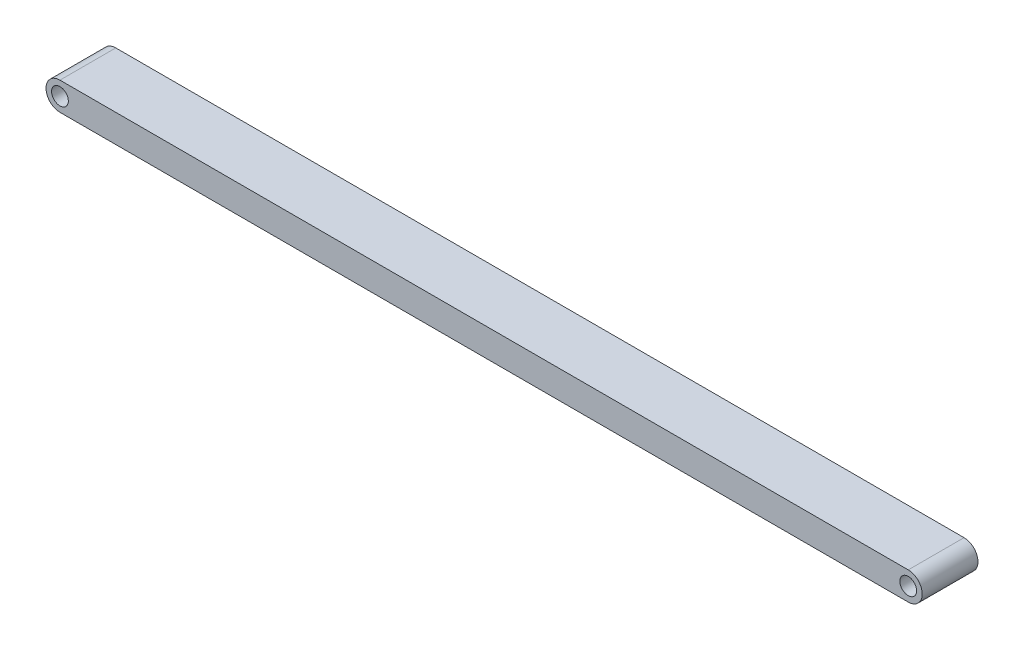
ISO-10303-21;
HEADER;
FILE_DESCRIPTION(('STEP AP214'),'2;1');
FILE_NAME('part.step','',(''),(''),'','','');
FILE_SCHEMA(('AUTOMOTIVE_DESIGN { 1 0 10303 214 1 1 1 1 }'));
ENDSEC;
DATA;
#1=APPLICATION_CONTEXT('core data for automotive mechanical design processes');
#2=APPLICATION_PROTOCOL_DEFINITION('international standard','automotive_design',2000,#1);
#3=PRODUCT_CONTEXT('',#1,'mechanical');
#4=PRODUCT('Part','Part','',(#3));
#5=PRODUCT_RELATED_PRODUCT_CATEGORY('part','',(#4));
#6=PRODUCT_DEFINITION_FORMATION('','',#4);
#7=PRODUCT_DEFINITION_CONTEXT('part definition',#1,'design');
#8=PRODUCT_DEFINITION('design','',#6,#7);
#9=PRODUCT_DEFINITION_SHAPE('','',#8);
#10=(LENGTH_UNIT() NAMED_UNIT(*) SI_UNIT(.MILLI.,.METRE.));
#11=(NAMED_UNIT(*) PLANE_ANGLE_UNIT() SI_UNIT($,.RADIAN.));
#12=(NAMED_UNIT(*) SI_UNIT($,.STERADIAN.) SOLID_ANGLE_UNIT());
#13=UNCERTAINTY_MEASURE_WITH_UNIT(LENGTH_MEASURE(1.E-05),#10,'distance_accuracy_value','');
#14=(GEOMETRIC_REPRESENTATION_CONTEXT(3) GLOBAL_UNCERTAINTY_ASSIGNED_CONTEXT((#13)) GLOBAL_UNIT_ASSIGNED_CONTEXT((#10,
#11,#12)) REPRESENTATION_CONTEXT('',''));
#15=CARTESIAN_POINT('',(0.,0.,0.));
#16=DIRECTION('',(0.,0.,1.));
#17=DIRECTION('',(1.,0.,0.));
#18=AXIS2_PLACEMENT_3D('',#15,#16,#17);
#19=CARTESIAN_POINT('',(0.,2.5,-10.));
#20=DIRECTION('',(0.,0.,-1.));
#21=DIRECTION('',(1.,0.,0.));
#22=AXIS2_PLACEMENT_3D('',#19,#20,#21);
#23=PLANE('',#22);
#24=CARTESIAN_POINT('',(0.,2.5,-10.));
#25=DIRECTION('',(0.,0.,1.));
#26=DIRECTION('',(1.,0.,0.));
#27=AXIS2_PLACEMENT_3D('',#24,#25,#26);
#28=CIRCLE('',#27,1.5);
#29=CARTESIAN_POINT('',(1.5,2.5,-10.));
#30=VERTEX_POINT('',#29);
#31=EDGE_CURVE('E103',#30,#30,#28,.T.);
#32=ORIENTED_EDGE('',*,*,#31,.T.);
#33=EDGE_LOOP('',(#32));
#34=FACE_BOUND('',#33,.T.);
#35=CARTESIAN_POINT('',(0.,2.5,-10.));
#36=DIRECTION('',(0.,0.,1.));
#37=DIRECTION('',(1.,0.,0.));
#38=AXIS2_PLACEMENT_3D('',#35,#36,#37);
#39=CIRCLE('',#38,2.5);
#40=CARTESIAN_POINT('',(0.,5.,-10.));
#41=VERTEX_POINT('',#40);
#42=CARTESIAN_POINT('',(0.,0.,-10.));
#43=VERTEX_POINT('',#42);
#44=EDGE_CURVE('E91',#41,#43,#39,.T.);
#45=ORIENTED_EDGE('',*,*,#44,.F.);
#46=DIRECTION('',(-1.,0.,0.));
#47=VECTOR('',#46,1.);
#48=CARTESIAN_POINT('',(0.,5.,-10.));
#49=LINE('',#48,#47);
#50=CARTESIAN_POINT('',(152.,5.,-10.));
#51=VERTEX_POINT('',#50);
#52=EDGE_CURVE('E94',#51,#41,#49,.T.);
#53=ORIENTED_EDGE('',*,*,#52,.F.);
#54=CARTESIAN_POINT('',(152.,2.5,-10.));
#55=DIRECTION('',(0.,0.,1.));
#56=DIRECTION('',(-1.,0.,0.));
#57=AXIS2_PLACEMENT_3D('',#54,#55,#56);
#58=CIRCLE('',#57,2.5);
#59=CARTESIAN_POINT('',(152.,0.,-10.));
#60=VERTEX_POINT('',#59);
#61=EDGE_CURVE('E82',#60,#51,#58,.T.);
#62=ORIENTED_EDGE('',*,*,#61,.F.);
#63=DIRECTION('',(1.,0.,0.));
#64=VECTOR('',#63,1.);
#65=CARTESIAN_POINT('',(0.,0.,-10.));
#66=LINE('',#65,#64);
#67=EDGE_CURVE('E87',#43,#60,#66,.T.);
#68=ORIENTED_EDGE('',*,*,#67,.F.);
#69=EDGE_LOOP('',(#45,#53,#62,#68));
#70=FACE_BOUND('',#69,.T.);
#71=CARTESIAN_POINT('',(152.,2.5,-10.));
#72=DIRECTION('',(0.,0.,1.));
#73=DIRECTION('',(1.,0.,0.));
#74=AXIS2_PLACEMENT_3D('',#71,#72,#73);
#75=CIRCLE('',#74,1.5);
#76=CARTESIAN_POINT('',(153.5,2.5,-10.));
#77=VERTEX_POINT('',#76);
#78=EDGE_CURVE('E114',#77,#77,#75,.T.);
#79=ORIENTED_EDGE('',*,*,#78,.T.);
#80=EDGE_LOOP('',(#79));
#81=FACE_BOUND('',#80,.T.);
#82=ADVANCED_FACE('F35',(#34,#70,#81),#23,.T.);
#83=CARTESIAN_POINT('',(0.,2.5,0.));
#84=DIRECTION('',(0.,0.,-1.));
#85=DIRECTION('',(1.,0.,0.));
#86=AXIS2_PLACEMENT_3D('',#83,#84,#85);
#87=PLANE('',#86);
#88=CARTESIAN_POINT('',(0.,2.5,0.));
#89=DIRECTION('',(0.,0.,1.));
#90=DIRECTION('',(1.,0.,0.));
#91=AXIS2_PLACEMENT_3D('',#88,#89,#90);
#92=CIRCLE('',#91,2.5);
#93=CARTESIAN_POINT('',(0.,5.,0.));
#94=VERTEX_POINT('',#93);
#95=CARTESIAN_POINT('',(0.,0.,0.));
#96=VERTEX_POINT('',#95);
#97=EDGE_CURVE('E99',#94,#96,#92,.T.);
#98=ORIENTED_EDGE('',*,*,#97,.T.);
#99=DIRECTION('',(1.,0.,0.));
#100=VECTOR('',#99,1.);
#101=CARTESIAN_POINT('',(0.,0.,0.));
#102=LINE('',#101,#100);
#103=CARTESIAN_POINT('',(152.,0.,0.));
#104=VERTEX_POINT('',#103);
#105=EDGE_CURVE('E102',#96,#104,#102,.T.);
#106=ORIENTED_EDGE('',*,*,#105,.T.);
#107=CARTESIAN_POINT('',(152.,2.5,0.));
#108=DIRECTION('',(0.,0.,1.));
#109=DIRECTION('',(-1.,0.,0.));
#110=AXIS2_PLACEMENT_3D('',#107,#108,#109);
#111=CIRCLE('',#110,2.5);
#112=CARTESIAN_POINT('',(152.,5.,0.));
#113=VERTEX_POINT('',#112);
#114=EDGE_CURVE('E85',#104,#113,#111,.T.);
#115=ORIENTED_EDGE('',*,*,#114,.T.);
#116=DIRECTION('',(-1.,0.,0.));
#117=VECTOR('',#116,1.);
#118=CARTESIAN_POINT('',(0.,5.,0.));
#119=LINE('',#118,#117);
#120=EDGE_CURVE('E106',#113,#94,#119,.T.);
#121=ORIENTED_EDGE('',*,*,#120,.T.);
#122=EDGE_LOOP('',(#98,#106,#115,#121));
#123=FACE_BOUND('',#122,.T.);
#124=CARTESIAN_POINT('',(0.,2.5,0.));
#125=DIRECTION('',(0.,0.,1.));
#126=DIRECTION('',(1.,0.,0.));
#127=AXIS2_PLACEMENT_3D('',#124,#125,#126);
#128=CIRCLE('',#127,1.5);
#129=CARTESIAN_POINT('',(1.5,2.5,0.));
#130=VERTEX_POINT('',#129);
#131=EDGE_CURVE('E111',#130,#130,#128,.T.);
#132=ORIENTED_EDGE('',*,*,#131,.F.);
#133=EDGE_LOOP('',(#132));
#134=FACE_BOUND('',#133,.T.);
#135=CARTESIAN_POINT('',(152.,2.5,0.));
#136=DIRECTION('',(0.,0.,1.));
#137=DIRECTION('',(1.,0.,0.));
#138=AXIS2_PLACEMENT_3D('',#135,#136,#137);
#139=CIRCLE('',#138,1.5);
#140=CARTESIAN_POINT('',(153.5,2.5,0.));
#141=VERTEX_POINT('',#140);
#142=EDGE_CURVE('E117',#141,#141,#139,.T.);
#143=ORIENTED_EDGE('',*,*,#142,.F.);
#144=EDGE_LOOP('',(#143));
#145=FACE_BOUND('',#144,.T.);
#146=ADVANCED_FACE('F130',(#123,#134,#145),#87,.F.);
#147=CARTESIAN_POINT('',(0.,2.5,-10.));
#148=DIRECTION('',(0.,0.,1.));
#149=DIRECTION('',(-1.,0.,0.));
#150=AXIS2_PLACEMENT_3D('',#147,#148,#149);
#151=CYLINDRICAL_SURFACE('',#150,2.5);
#152=ORIENTED_EDGE('',*,*,#97,.F.);
#153=DIRECTION('',(0.,0.,1.));
#154=VECTOR('',#153,1.);
#155=CARTESIAN_POINT('',(0.,5.,-10.));
#156=LINE('',#155,#154);
#157=EDGE_CURVE('E52',#41,#94,#156,.T.);
#158=ORIENTED_EDGE('',*,*,#157,.F.);
#159=ORIENTED_EDGE('',*,*,#44,.T.);
#160=DIRECTION('',(0.,0.,1.));
#161=VECTOR('',#160,1.);
#162=CARTESIAN_POINT('',(0.,0.,-10.));
#163=LINE('',#162,#161);
#164=EDGE_CURVE('E11',#43,#96,#163,.T.);
#165=ORIENTED_EDGE('',*,*,#164,.T.);
#166=EDGE_LOOP('',(#152,#158,#159,#165));
#167=FACE_BOUND('',#166,.T.);
#168=ADVANCED_FACE('F37',(#167),#151,.T.);
#169=CARTESIAN_POINT('',(0.,0.,-10.));
#170=DIRECTION('',(0.,1.,0.));
#171=DIRECTION('',(0.,0.,-1.));
#172=AXIS2_PLACEMENT_3D('',#169,#170,#171);
#173=PLANE('',#172);
#174=ORIENTED_EDGE('',*,*,#105,.F.);
#175=ORIENTED_EDGE('',*,*,#164,.F.);
#176=ORIENTED_EDGE('',*,*,#67,.T.);
#177=DIRECTION('',(0.,0.,1.));
#178=VECTOR('',#177,1.);
#179=CARTESIAN_POINT('',(152.,0.,-10.));
#180=LINE('',#179,#178);
#181=EDGE_CURVE('E44',#60,#104,#180,.T.);
#182=ORIENTED_EDGE('',*,*,#181,.T.);
#183=EDGE_LOOP('',(#174,#175,#176,#182));
#184=FACE_BOUND('',#183,.T.);
#185=ADVANCED_FACE('F88',(#184),#173,.F.);
#186=CARTESIAN_POINT('',(152.,2.5,-10.));
#187=DIRECTION('',(0.,0.,1.));
#188=DIRECTION('',(-1.,0.,0.));
#189=AXIS2_PLACEMENT_3D('',#186,#187,#188);
#190=CYLINDRICAL_SURFACE('',#189,2.5);
#191=ORIENTED_EDGE('',*,*,#114,.F.);
#192=ORIENTED_EDGE('',*,*,#181,.F.);
#193=ORIENTED_EDGE('',*,*,#61,.T.);
#194=DIRECTION('',(0.,0.,1.));
#195=VECTOR('',#194,1.);
#196=CARTESIAN_POINT('',(152.,5.,-10.));
#197=LINE('',#196,#195);
#198=EDGE_CURVE('E68',#51,#113,#197,.T.);
#199=ORIENTED_EDGE('',*,*,#198,.T.);
#200=EDGE_LOOP('',(#191,#192,#193,#199));
#201=FACE_BOUND('',#200,.T.);
#202=ADVANCED_FACE('F80',(#201),#190,.T.);
#203=CARTESIAN_POINT('',(0.,5.,-10.));
#204=DIRECTION('',(0.,-1.,0.));
#205=DIRECTION('',(1.,0.,0.));
#206=AXIS2_PLACEMENT_3D('',#203,#204,#205);
#207=PLANE('',#206);
#208=ORIENTED_EDGE('',*,*,#120,.F.);
#209=ORIENTED_EDGE('',*,*,#198,.F.);
#210=ORIENTED_EDGE('',*,*,#52,.T.);
#211=ORIENTED_EDGE('',*,*,#157,.T.);
#212=EDGE_LOOP('',(#208,#209,#210,#211));
#213=FACE_BOUND('',#212,.T.);
#214=ADVANCED_FACE('F142',(#213),#207,.F.);
#215=CARTESIAN_POINT('',(0.,2.5,-10.));
#216=DIRECTION('',(0.,0.,1.));
#217=DIRECTION('',(-1.,0.,0.));
#218=AXIS2_PLACEMENT_3D('',#215,#216,#217);
#219=CYLINDRICAL_SURFACE('',#218,1.5);
#220=ORIENTED_EDGE('',*,*,#31,.F.);
#221=EDGE_LOOP('',(#220));
#222=FACE_BOUND('',#221,.T.);
#223=ORIENTED_EDGE('',*,*,#131,.T.);
#224=EDGE_LOOP('',(#223));
#225=FACE_BOUND('',#224,.T.);
#226=ADVANCED_FACE('F126',(#222,#225),#219,.F.);
#227=CARTESIAN_POINT('',(152.,2.5,-10.));
#228=DIRECTION('',(0.,0.,1.));
#229=DIRECTION('',(-1.,0.,0.));
#230=AXIS2_PLACEMENT_3D('',#227,#228,#229);
#231=CYLINDRICAL_SURFACE('',#230,1.5);
#232=ORIENTED_EDGE('',*,*,#78,.F.);
#233=EDGE_LOOP('',(#232));
#234=FACE_BOUND('',#233,.T.);
#235=ORIENTED_EDGE('',*,*,#142,.T.);
#236=EDGE_LOOP('',(#235));
#237=FACE_BOUND('',#236,.T.);
#238=ADVANCED_FACE('F123',(#234,#237),#231,.F.);
#239=CLOSED_SHELL('',(#82,#146,#168,#185,#202,#214,#226,#238));
#240=MANIFOLD_SOLID_BREP('B2',#239);
#241=ADVANCED_BREP_SHAPE_REPRESENTATION('',(#18,#240),#14);
#242=SHAPE_DEFINITION_REPRESENTATION(#9,#241);
ENDSEC;
END-ISO-10303-21;
